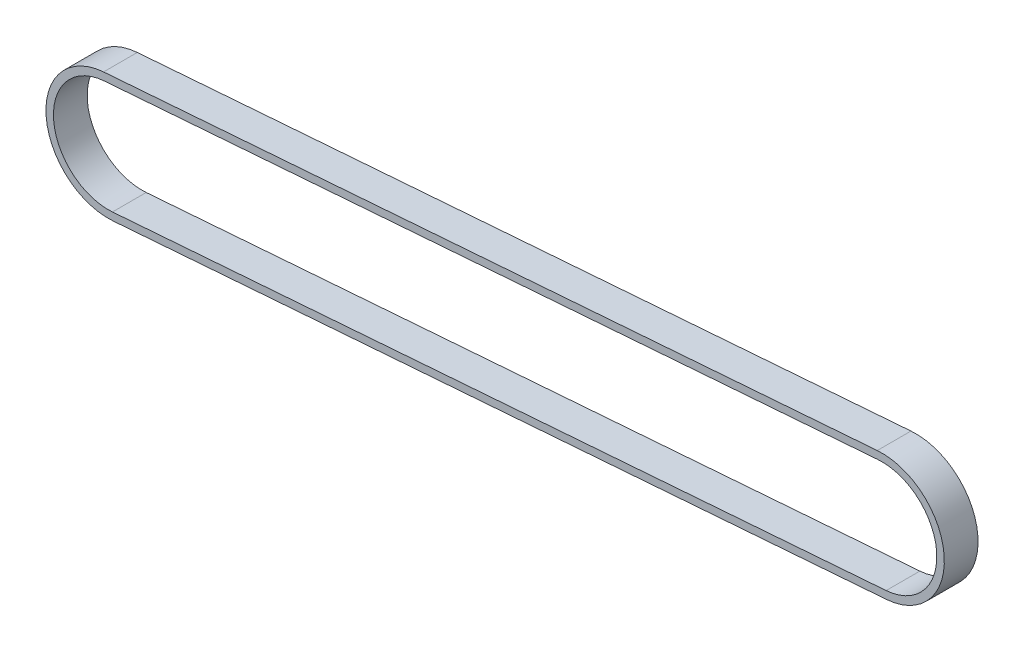
ISO-10303-21;
HEADER;
FILE_DESCRIPTION(('STEP AP214'),'2;1');
FILE_NAME('part.step','',(''),(''),'','','');
FILE_SCHEMA(('AUTOMOTIVE_DESIGN { 1 0 10303 214 1 1 1 1 }'));
ENDSEC;
DATA;
#1=APPLICATION_CONTEXT('core data for automotive mechanical design processes');
#2=APPLICATION_PROTOCOL_DEFINITION('international standard','automotive_design',2000,#1);
#3=PRODUCT_CONTEXT('',#1,'mechanical');
#4=PRODUCT('Part','Part','',(#3));
#5=PRODUCT_RELATED_PRODUCT_CATEGORY('part','',(#4));
#6=PRODUCT_DEFINITION_FORMATION('','',#4);
#7=PRODUCT_DEFINITION_CONTEXT('part definition',#1,'design');
#8=PRODUCT_DEFINITION('design','',#6,#7);
#9=PRODUCT_DEFINITION_SHAPE('','',#8);
#10=(LENGTH_UNIT() NAMED_UNIT(*) SI_UNIT(.MILLI.,.METRE.));
#11=(NAMED_UNIT(*) PLANE_ANGLE_UNIT() SI_UNIT($,.RADIAN.));
#12=(NAMED_UNIT(*) SI_UNIT($,.STERADIAN.) SOLID_ANGLE_UNIT());
#13=UNCERTAINTY_MEASURE_WITH_UNIT(LENGTH_MEASURE(1.E-05),#10,'distance_accuracy_value','');
#14=(GEOMETRIC_REPRESENTATION_CONTEXT(3) GLOBAL_UNCERTAINTY_ASSIGNED_CONTEXT((#13)) GLOBAL_UNIT_ASSIGNED_CONTEXT((#10,
#11,#12)) REPRESENTATION_CONTEXT('',''));
#15=CARTESIAN_POINT('',(0.,0.,0.));
#16=DIRECTION('',(0.,0.,1.));
#17=DIRECTION('',(1.,0.,0.));
#18=AXIS2_PLACEMENT_3D('',#15,#16,#17);
#19=CARTESIAN_POINT('',(-1.82724075316511,21.1050287705782,320.827296379562));
#20=DIRECTION('',(0.0760093975563843,-0.997107101310143,0.));
#21=DIRECTION('',(0.997107101310143,0.0760093975563843,0.));
#22=AXIS2_PLACEMENT_3D('',#19,#20,#21);
#23=PLANE('',#22);
#24=DIRECTION('',(-0.997107101310143,-0.0760093975563843,0.));
#25=VECTOR('',#24,1.);
#26=CARTESIAN_POINT('',(-1.82724075316495,21.1050287705782,11.3827369283026));
#27=LINE('',#26,#25);
#28=CARTESIAN_POINT('',(259.26602369777,41.0081482156904,11.3827369283027));
#29=VERTEX_POINT('',#28);
#30=CARTESIAN_POINT('',(-1.82724075316511,21.1050287705782,11.3827369283026));
#31=VERTEX_POINT('',#30);
#32=EDGE_CURVE('E181',#29,#31,#27,.T.);
#33=ORIENTED_EDGE('',*,*,#32,.F.);
#34=DIRECTION('',(0.,0.,-1.));
#35=VECTOR('',#34,1.);
#36=CARTESIAN_POINT('',(259.26602369777,41.0081482156904,320.827296379562));
#37=LINE('',#36,#35);
#38=CARTESIAN_POINT('',(259.26602369777,41.0081482156904,0.));
#39=VERTEX_POINT('',#38);
#40=EDGE_CURVE('E72',#29,#39,#37,.T.);
#41=ORIENTED_EDGE('',*,*,#40,.T.);
#42=DIRECTION('',(-0.997107101310143,-0.0760093975563843,0.));
#43=VECTOR('',#42,1.);
#44=CARTESIAN_POINT('',(-1.82724075316511,21.1050287705782,0.));
#45=LINE('',#44,#43);
#46=CARTESIAN_POINT('',(-1.82724075316511,21.1050287705782,0.));
#47=VERTEX_POINT('',#46);
#48=EDGE_CURVE('E155',#39,#47,#45,.T.);
#49=ORIENTED_EDGE('',*,*,#48,.T.);
#50=DIRECTION('',(0.,0.,-1.));
#51=VECTOR('',#50,1.);
#52=CARTESIAN_POINT('',(-1.82724075316511,21.1050287705782,320.827296379562));
#53=LINE('',#52,#51);
#54=EDGE_CURVE('E158',#31,#47,#53,.T.);
#55=ORIENTED_EDGE('',*,*,#54,.F.);
#56=EDGE_LOOP('',(#33,#41,#49,#55));
#57=FACE_BOUND('',#56,.T.);
#58=ADVANCED_FACE('F57',(#57),#23,.F.);
#59=CARTESIAN_POINT('',(260.865261422357,20.029014804125,320.827296379562));
#60=DIRECTION('',(0.,0.,-1.));
#61=DIRECTION('',(-1.,0.,0.));
#62=AXIS2_PLACEMENT_3D('',#59,#60,#61);
#63=CYLINDRICAL_SURFACE('',#62,21.04);
#64=CARTESIAN_POINT('',(260.865261422357,20.029014804125,11.3827369283027));
#65=DIRECTION('',(0.,0.,1.));
#66=DIRECTION('',(1.,0.,0.));
#67=AXIS2_PLACEMENT_3D('',#64,#65,#66);
#68=CIRCLE('',#67,21.04);
#69=CARTESIAN_POINT('',(262.464499146943,-0.950118607440432,11.3827369283027));
#70=VERTEX_POINT('',#69);
#71=EDGE_CURVE('E184',#70,#29,#68,.T.);
#72=ORIENTED_EDGE('',*,*,#71,.F.);
#73=DIRECTION('',(0.,0.,-1.));
#74=VECTOR('',#73,1.);
#75=CARTESIAN_POINT('',(262.464499146943,-0.950118607440432,320.827296379562));
#76=LINE('',#75,#74);
#77=CARTESIAN_POINT('',(262.464499146943,-0.950118607440432,0.));
#78=VERTEX_POINT('',#77);
#79=EDGE_CURVE('E161',#70,#78,#76,.T.);
#80=ORIENTED_EDGE('',*,*,#79,.T.);
#81=CARTESIAN_POINT('',(260.865261422357,20.029014804125,0.));
#82=DIRECTION('',(0.,0.,-1.));
#83=DIRECTION('',(-1.,0.,0.));
#84=AXIS2_PLACEMENT_3D('',#81,#82,#83);
#85=CIRCLE('',#84,21.04);
#86=EDGE_CURVE('E153',#78,#39,#85,.F.);
#87=ORIENTED_EDGE('',*,*,#86,.T.);
#88=ORIENTED_EDGE('',*,*,#40,.F.);
#89=EDGE_LOOP('',(#72,#80,#87,#88));
#90=FACE_BOUND('',#89,.T.);
#91=ADVANCED_FACE('F183',(#90),#63,.T.);
#92=CARTESIAN_POINT('',(1.37123469600754,-20.8532380525526,320.827296379562));
#93=DIRECTION('',(-0.0760093975563843,0.997107101310143,0.));
#94=DIRECTION('',(-0.997107101310143,-0.0760093975563843,0.));
#95=AXIS2_PLACEMENT_3D('',#92,#93,#94);
#96=PLANE('',#95);
#97=DIRECTION('',(0.997107101310143,0.0760093975563843,0.));
#98=VECTOR('',#97,1.);
#99=CARTESIAN_POINT('',(1.3712346960077,-20.8532380525526,11.3827369283026));
#100=LINE('',#99,#98);
#101=CARTESIAN_POINT('',(1.37123469600747,-20.8532380525526,11.3827369283027));
#102=VERTEX_POINT('',#101);
#103=EDGE_CURVE('E169',#102,#70,#100,.T.);
#104=ORIENTED_EDGE('',*,*,#103,.F.);
#105=DIRECTION('',(0.,0.,-1.));
#106=VECTOR('',#105,1.);
#107=CARTESIAN_POINT('',(1.37123469600747,-20.8532380525526,320.827296379562));
#108=LINE('',#107,#106);
#109=CARTESIAN_POINT('',(1.37123469600747,-20.8532380525526,0.));
#110=VERTEX_POINT('',#109);
#111=EDGE_CURVE('E65',#102,#110,#108,.T.);
#112=ORIENTED_EDGE('',*,*,#111,.T.);
#113=DIRECTION('',(0.997107101310143,0.0760093975563843,0.));
#114=VECTOR('',#113,1.);
#115=CARTESIAN_POINT('',(1.37123469600754,-20.8532380525526,0.));
#116=LINE('',#115,#114);
#117=EDGE_CURVE('E150',#110,#78,#116,.T.);
#118=ORIENTED_EDGE('',*,*,#117,.T.);
#119=ORIENTED_EDGE('',*,*,#79,.F.);
#120=EDGE_LOOP('',(#104,#112,#118,#119));
#121=FACE_BOUND('',#120,.T.);
#122=ADVANCED_FACE('F165',(#121),#96,.F.);
#123=CARTESIAN_POINT('',(-0.228003028578783,0.125895359012806,320.827296379562));
#124=DIRECTION('',(0.,0.,-1.));
#125=DIRECTION('',(-1.,0.,0.));
#126=AXIS2_PLACEMENT_3D('',#123,#124,#125);
#127=CYLINDRICAL_SURFACE('',#126,21.04);
#128=CARTESIAN_POINT('',(-0.228003028578783,0.125895359012806,11.3827369283026));
#129=DIRECTION('',(0.,0.,1.));
#130=DIRECTION('',(1.,0.,0.));
#131=AXIS2_PLACEMENT_3D('',#128,#129,#130);
#132=CIRCLE('',#131,21.04);
#133=EDGE_CURVE('E178',#31,#102,#132,.T.);
#134=ORIENTED_EDGE('',*,*,#133,.F.);
#135=ORIENTED_EDGE('',*,*,#54,.T.);
#136=CARTESIAN_POINT('',(-0.228003028578783,0.125895359012806,0.));
#137=DIRECTION('',(0.,0.,-1.));
#138=DIRECTION('',(-1.,0.,0.));
#139=AXIS2_PLACEMENT_3D('',#136,#137,#138);
#140=CIRCLE('',#139,21.04);
#141=EDGE_CURVE('E147',#47,#110,#140,.F.);
#142=ORIENTED_EDGE('',*,*,#141,.T.);
#143=ORIENTED_EDGE('',*,*,#111,.F.);
#144=EDGE_LOOP('',(#134,#135,#142,#143));
#145=FACE_BOUND('',#144,.T.);
#146=ADVANCED_FACE('F59',(#145),#127,.T.);
#147=CARTESIAN_POINT('',(-0.228003028578783,0.125895359012806,0.));
#148=DIRECTION('',(0.,0.,-1.));
#149=DIRECTION('',(-1.,0.,0.));
#150=AXIS2_PLACEMENT_3D('',#147,#148,#149);
#151=PLANE('',#150);
#152=ORIENTED_EDGE('',*,*,#141,.F.);
#153=ORIENTED_EDGE('',*,*,#48,.F.);
#154=ORIENTED_EDGE('',*,*,#86,.F.);
#155=ORIENTED_EDGE('',*,*,#117,.F.);
#156=EDGE_LOOP('',(#152,#153,#154,#155));
#157=FACE_BOUND('',#156,.T.);
#158=DIRECTION('',(-0.997107101310143,-0.0760093975563843,0.));
#159=VECTOR('',#158,1.);
#160=CARTESIAN_POINT('',(-1.63417688337189,18.5723767332504,0.));
#161=LINE('',#160,#159);
#162=CARTESIAN_POINT('',(259.459087567563,38.4754961783626,0.));
#163=VERTEX_POINT('',#162);
#164=CARTESIAN_POINT('',(-1.63417688337189,18.5723767332504,0.));
#165=VERTEX_POINT('',#164);
#166=EDGE_CURVE('E137',#163,#165,#161,.T.);
#167=ORIENTED_EDGE('',*,*,#166,.T.);
#168=CARTESIAN_POINT('',(-0.228003028578783,0.125895359012806,0.));
#169=DIRECTION('',(0.,0.,1.));
#170=DIRECTION('',(-1.,0.,0.));
#171=AXIS2_PLACEMENT_3D('',#168,#169,#170);
#172=CIRCLE('',#171,18.5);
#173=CARTESIAN_POINT('',(1.17817082621433,-18.3205860152248,0.));
#174=VERTEX_POINT('',#173);
#175=EDGE_CURVE('E186',#165,#174,#172,.T.);
#176=ORIENTED_EDGE('',*,*,#175,.T.);
#177=DIRECTION('',(0.997107101310143,0.0760093975563843,0.));
#178=VECTOR('',#177,1.);
#179=CARTESIAN_POINT('',(262.27143527715,1.58253342988733,0.));
#180=LINE('',#179,#178);
#181=CARTESIAN_POINT('',(262.27143527715,1.58253342988733,0.));
#182=VERTEX_POINT('',#181);
#183=EDGE_CURVE('E193',#174,#182,#180,.T.);
#184=ORIENTED_EDGE('',*,*,#183,.T.);
#185=CARTESIAN_POINT('',(260.865261422357,20.029014804125,0.));
#186=DIRECTION('',(0.,0.,1.));
#187=DIRECTION('',(-1.,0.,0.));
#188=AXIS2_PLACEMENT_3D('',#185,#186,#187);
#189=CIRCLE('',#188,18.5);
#190=EDGE_CURVE('E196',#182,#163,#189,.T.);
#191=ORIENTED_EDGE('',*,*,#190,.T.);
#192=EDGE_LOOP('',(#167,#176,#184,#191));
#193=FACE_BOUND('',#192,.T.);
#194=ADVANCED_FACE('F175',(#157,#193),#151,.T.);
#195=CARTESIAN_POINT('',(-1.63417688337189,18.5723767332504,320.827296379562));
#196=DIRECTION('',(0.0760093975563843,-0.997107101310143,0.));
#197=DIRECTION('',(0.997107101310143,0.0760093975563843,0.));
#198=AXIS2_PLACEMENT_3D('',#195,#196,#197);
#199=PLANE('',#198);
#200=DIRECTION('',(0.,0.,-1.));
#201=VECTOR('',#200,1.);
#202=CARTESIAN_POINT('',(259.459087567563,38.4754961783626,320.827296379562));
#203=LINE('',#202,#201);
#204=CARTESIAN_POINT('',(259.459087567563,38.4754961783626,11.3827369283027));
#205=VERTEX_POINT('',#204);
#206=EDGE_CURVE('E129',#205,#163,#203,.T.);
#207=ORIENTED_EDGE('',*,*,#206,.F.);
#208=DIRECTION('',(-0.997107101310143,-0.0760093975563843,0.));
#209=VECTOR('',#208,1.);
#210=CARTESIAN_POINT('',(-1.63417688337173,18.5723767332505,11.3827369283026));
#211=LINE('',#210,#209);
#212=CARTESIAN_POINT('',(-1.63417688337189,18.5723767332504,11.3827369283027));
#213=VERTEX_POINT('',#212);
#214=EDGE_CURVE('E12',#205,#213,#211,.T.);
#215=ORIENTED_EDGE('',*,*,#214,.T.);
#216=DIRECTION('',(0.,0.,-1.));
#217=VECTOR('',#216,1.);
#218=CARTESIAN_POINT('',(-1.63417688337189,18.5723767332504,320.827296379562));
#219=LINE('',#218,#217);
#220=EDGE_CURVE('E139',#213,#165,#219,.T.);
#221=ORIENTED_EDGE('',*,*,#220,.T.);
#222=ORIENTED_EDGE('',*,*,#166,.F.);
#223=EDGE_LOOP('',(#207,#215,#221,#222));
#224=FACE_BOUND('',#223,.T.);
#225=ADVANCED_FACE('F135',(#224),#199,.T.);
#226=CARTESIAN_POINT('',(260.865261422357,20.029014804125,320.827296379562));
#227=DIRECTION('',(0.,0.,-1.));
#228=DIRECTION('',(-1.,0.,0.));
#229=AXIS2_PLACEMENT_3D('',#226,#227,#228);
#230=CYLINDRICAL_SURFACE('',#229,18.5);
#231=DIRECTION('',(0.,0.,-1.));
#232=VECTOR('',#231,1.);
#233=CARTESIAN_POINT('',(262.27143527715,1.58253342988733,320.827296379562));
#234=LINE('',#233,#232);
#235=CARTESIAN_POINT('',(262.27143527715,1.58253342988733,11.3827369283027));
#236=VERTEX_POINT('',#235);
#237=EDGE_CURVE('E131',#236,#182,#234,.T.);
#238=ORIENTED_EDGE('',*,*,#237,.F.);
#239=CARTESIAN_POINT('',(260.865261422357,20.029014804125,11.3827369283027));
#240=DIRECTION('',(0.,0.,1.));
#241=DIRECTION('',(1.,0.,0.));
#242=AXIS2_PLACEMENT_3D('',#239,#240,#241);
#243=CIRCLE('',#242,18.5);
#244=EDGE_CURVE('E122',#236,#205,#243,.T.);
#245=ORIENTED_EDGE('',*,*,#244,.T.);
#246=ORIENTED_EDGE('',*,*,#206,.T.);
#247=ORIENTED_EDGE('',*,*,#190,.F.);
#248=EDGE_LOOP('',(#238,#245,#246,#247));
#249=FACE_BOUND('',#248,.T.);
#250=ADVANCED_FACE('F127',(#249),#230,.F.);
#251=CARTESIAN_POINT('',(262.27143527715,1.58253342988733,320.827296379562));
#252=DIRECTION('',(-0.0760093975563843,0.997107101310143,0.));
#253=DIRECTION('',(-0.997107101310143,-0.0760093975563843,0.));
#254=AXIS2_PLACEMENT_3D('',#251,#252,#253);
#255=PLANE('',#254);
#256=DIRECTION('',(0.,0.,-1.));
#257=VECTOR('',#256,1.);
#258=CARTESIAN_POINT('',(1.17817082621433,-18.3205860152248,320.827296379562));
#259=LINE('',#258,#257);
#260=CARTESIAN_POINT('',(1.17817082621435,-18.3205860152248,11.3827369283026));
#261=VERTEX_POINT('',#260);
#262=EDGE_CURVE('E141',#261,#174,#259,.T.);
#263=ORIENTED_EDGE('',*,*,#262,.F.);
#264=DIRECTION('',(0.997107101310143,0.0760093975563843,0.));
#265=VECTOR('',#264,1.);
#266=CARTESIAN_POINT('',(262.27143527715,1.58253342988734,11.3827369283028));
#267=LINE('',#266,#265);
#268=EDGE_CURVE('E133',#261,#236,#267,.T.);
#269=ORIENTED_EDGE('',*,*,#268,.T.);
#270=ORIENTED_EDGE('',*,*,#237,.T.);
#271=ORIENTED_EDGE('',*,*,#183,.F.);
#272=EDGE_LOOP('',(#263,#269,#270,#271));
#273=FACE_BOUND('',#272,.T.);
#274=ADVANCED_FACE('F201',(#273),#255,.T.);
#275=CARTESIAN_POINT('',(-0.228003028578783,0.125895359012806,320.827296379562));
#276=DIRECTION('',(0.,0.,-1.));
#277=DIRECTION('',(-1.,0.,0.));
#278=AXIS2_PLACEMENT_3D('',#275,#276,#277);
#279=CYLINDRICAL_SURFACE('',#278,18.5);
#280=ORIENTED_EDGE('',*,*,#220,.F.);
#281=CARTESIAN_POINT('',(-0.228003028578783,0.125895359012806,11.3827369283026));
#282=DIRECTION('',(0.,0.,1.));
#283=DIRECTION('',(1.,0.,0.));
#284=AXIS2_PLACEMENT_3D('',#281,#282,#283);
#285=CIRCLE('',#284,18.5);
#286=EDGE_CURVE('E80',#213,#261,#285,.T.);
#287=ORIENTED_EDGE('',*,*,#286,.T.);
#288=ORIENTED_EDGE('',*,*,#262,.T.);
#289=ORIENTED_EDGE('',*,*,#175,.F.);
#290=EDGE_LOOP('',(#280,#287,#288,#289));
#291=FACE_BOUND('',#290,.T.);
#292=ADVANCED_FACE('F205',(#291),#279,.F.);
#293=CARTESIAN_POINT('',(-0.228003028578786,0.125895359013307,11.3827369283025));
#294=DIRECTION('',(0.,0.,1.));
#295=DIRECTION('',(-0.445983290907205,-0.895041286327943,0.));
#296=AXIS2_PLACEMENT_3D('',#293,#294,#295);
#297=PLANE('',#296);
#298=ORIENTED_EDGE('',*,*,#286,.F.);
#299=ORIENTED_EDGE('',*,*,#214,.F.);
#300=ORIENTED_EDGE('',*,*,#244,.F.);
#301=ORIENTED_EDGE('',*,*,#268,.F.);
#302=EDGE_LOOP('',(#298,#299,#300,#301));
#303=FACE_BOUND('',#302,.T.);
#304=ORIENTED_EDGE('',*,*,#32,.T.);
#305=ORIENTED_EDGE('',*,*,#133,.T.);
#306=ORIENTED_EDGE('',*,*,#103,.T.);
#307=ORIENTED_EDGE('',*,*,#71,.T.);
#308=EDGE_LOOP('',(#304,#305,#306,#307));
#309=FACE_BOUND('',#308,.T.);
#310=ADVANCED_FACE('F120',(#303,#309),#297,.T.);
#311=CLOSED_SHELL('',(#58,#91,#122,#146,#194,#225,#250,#274,#292,#310));
#312=MANIFOLD_SOLID_BREP('B2',#311);
#313=ADVANCED_BREP_SHAPE_REPRESENTATION('',(#18,#312),#14);
#314=SHAPE_DEFINITION_REPRESENTATION(#9,#313);
ENDSEC;
END-ISO-10303-21;
